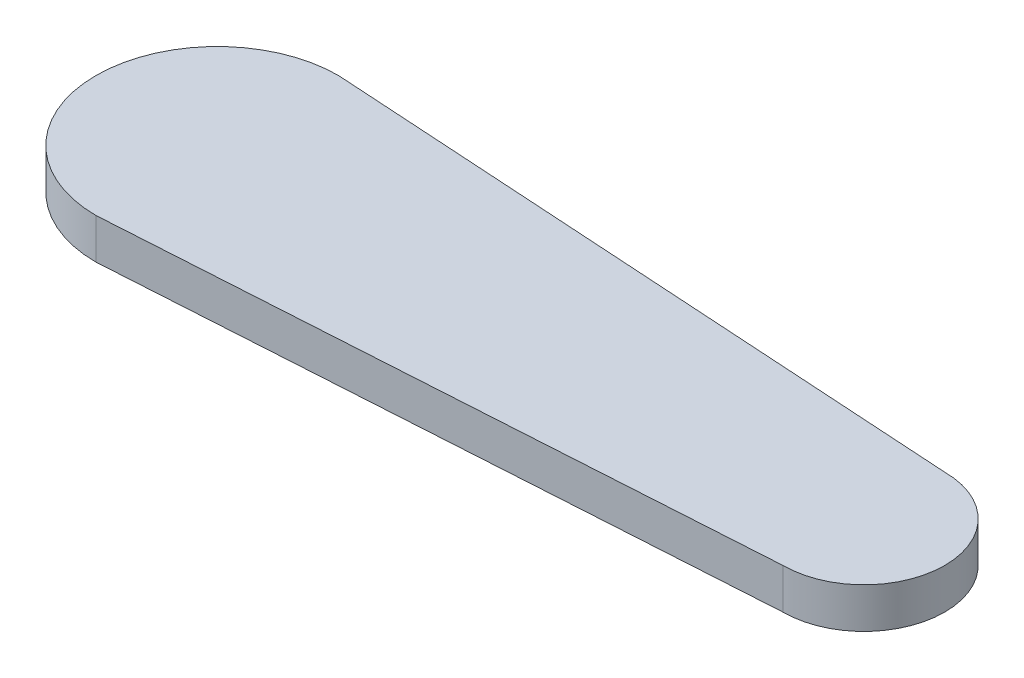
ISO-10303-21;
HEADER;
FILE_DESCRIPTION(('STEP AP214'),'2;1');
FILE_NAME('part.step','',(''),(''),'','','');
FILE_SCHEMA(('AUTOMOTIVE_DESIGN { 1 0 10303 214 1 1 1 1 }'));
ENDSEC;
DATA;
#1=APPLICATION_CONTEXT('core data for automotive mechanical design processes');
#2=APPLICATION_PROTOCOL_DEFINITION('international standard','automotive_design',2000,#1);
#3=PRODUCT_CONTEXT('',#1,'mechanical');
#4=PRODUCT('Part','Part','',(#3));
#5=PRODUCT_RELATED_PRODUCT_CATEGORY('part','',(#4));
#6=PRODUCT_DEFINITION_FORMATION('','',#4);
#7=PRODUCT_DEFINITION_CONTEXT('part definition',#1,'design');
#8=PRODUCT_DEFINITION('design','',#6,#7);
#9=PRODUCT_DEFINITION_SHAPE('','',#8);
#10=(LENGTH_UNIT() NAMED_UNIT(*) SI_UNIT(.MILLI.,.METRE.));
#11=(NAMED_UNIT(*) PLANE_ANGLE_UNIT() SI_UNIT($,.RADIAN.));
#12=(NAMED_UNIT(*) SI_UNIT($,.STERADIAN.) SOLID_ANGLE_UNIT());
#13=UNCERTAINTY_MEASURE_WITH_UNIT(LENGTH_MEASURE(1.E-05),#10,'distance_accuracy_value','');
#14=(GEOMETRIC_REPRESENTATION_CONTEXT(3) GLOBAL_UNCERTAINTY_ASSIGNED_CONTEXT((#13)) GLOBAL_UNIT_ASSIGNED_CONTEXT((#10,
#11,#12)) REPRESENTATION_CONTEXT('',''));
#15=CARTESIAN_POINT('',(0.,0.,0.));
#16=DIRECTION('',(0.,0.,1.));
#17=DIRECTION('',(1.,0.,0.));
#18=AXIS2_PLACEMENT_3D('',#15,#16,#17);
#19=CARTESIAN_POINT('',(0.,0.,0.));
#20=DIRECTION('',(0.,1.,0.));
#21=DIRECTION('',(0.,0.,1.));
#22=AXIS2_PLACEMENT_3D('',#19,#20,#21);
#23=PLANE('',#22);
#24=CARTESIAN_POINT('',(0.,0.,0.));
#25=DIRECTION('',(0.,1.,0.));
#26=DIRECTION('',(0.,0.,1.));
#27=AXIS2_PLACEMENT_3D('',#24,#25,#26);
#28=CIRCLE('',#27,15.);
#29=CARTESIAN_POINT('',(0.,0.,-15.));
#30=VERTEX_POINT('',#29);
#31=CARTESIAN_POINT('',(0.,0.,15.));
#32=VERTEX_POINT('',#31);
#33=EDGE_CURVE('E187',#30,#32,#28,.T.);
#34=ORIENTED_EDGE('',*,*,#33,.F.);
#35=DIRECTION('',(0.998052578482889,0.,0.0623782861551806));
#36=VECTOR('',#35,1.);
#37=CARTESIAN_POINT('',(0.,0.,-15.));
#38=LINE('',#37,#36);
#39=CARTESIAN_POINT('',(80.,0.,-9.99999999999999));
#40=VERTEX_POINT('',#39);
#41=EDGE_CURVE('E201',#30,#40,#38,.T.);
#42=ORIENTED_EDGE('',*,*,#41,.T.);
#43=CARTESIAN_POINT('',(80.,0.,0.));
#44=DIRECTION('',(0.,1.,0.));
#45=DIRECTION('',(0.,0.,1.));
#46=AXIS2_PLACEMENT_3D('',#43,#44,#45);
#47=CIRCLE('',#46,9.99999999999999);
#48=CARTESIAN_POINT('',(80.,0.,9.99999999999999));
#49=VERTEX_POINT('',#48);
#50=EDGE_CURVE('E212',#49,#40,#47,.T.);
#51=ORIENTED_EDGE('',*,*,#50,.F.);
#52=DIRECTION('',(0.998052578482889,0.,-0.0623782861551806));
#53=VECTOR('',#52,1.);
#54=CARTESIAN_POINT('',(0.,0.,15.));
#55=LINE('',#54,#53);
#56=EDGE_CURVE('E192',#32,#49,#55,.T.);
#57=ORIENTED_EDGE('',*,*,#56,.F.);
#58=EDGE_LOOP('',(#34,#42,#51,#57));
#59=FACE_BOUND('',#58,.T.);
#60=CARTESIAN_POINT('',(19.9,0.,-0.809743015161226));
#61=DIRECTION('',(0.,1.,0.));
#62=DIRECTION('',(0.,0.,1.));
#63=AXIS2_PLACEMENT_3D('',#60,#61,#62);
#64=CIRCLE('',#63,1.5);
#65=CARTESIAN_POINT('',(20.062072922643,0.,0.681475402021832));
#66=VERTEX_POINT('',#65);
#67=CARTESIAN_POINT('',(20.062072922643,0.,-2.30096143234428));
#68=VERTEX_POINT('',#67);
#69=EDGE_CURVE('E57',#66,#68,#64,.T.);
#70=ORIENTED_EDGE('',*,*,#69,.T.);
#71=DIRECTION('',(-0.994145611455372,0.,-0.108048615095358));
#72=VECTOR('',#71,1.);
#73=CARTESIAN_POINT('',(20.062072922643,0.,-2.30096143234428));
#74=LINE('',#73,#72);
#75=CARTESIAN_POINT('',(7.1,0.,-3.70974301516123));
#76=VERTEX_POINT('',#75);
#77=EDGE_CURVE('E185',#68,#76,#74,.T.);
#78=ORIENTED_EDGE('',*,*,#77,.T.);
#79=DIRECTION('',(0.,0.,-1.));
#80=VECTOR('',#79,1.);
#81=CARTESIAN_POINT('',(7.1,0.,-3.70974301516123));
#82=LINE('',#81,#80);
#83=CARTESIAN_POINT('',(7.1,0.,-7.55974301516122));
#84=VERTEX_POINT('',#83);
#85=EDGE_CURVE('E459',#76,#84,#82,.T.);
#86=ORIENTED_EDGE('',*,*,#85,.T.);
#87=CARTESIAN_POINT('',(5.2,0.,-7.55974301516122));
#88=DIRECTION('',(0.,1.,0.));
#89=DIRECTION('',(0.,0.,1.));
#90=AXIS2_PLACEMENT_3D('',#87,#88,#89);
#91=CIRCLE('',#90,1.9);
#92=CARTESIAN_POINT('',(3.3,0.,-7.55974301516122));
#93=VERTEX_POINT('',#92);
#94=EDGE_CURVE('E461',#84,#93,#91,.T.);
#95=ORIENTED_EDGE('',*,*,#94,.T.);
#96=DIRECTION('',(0.,0.,1.));
#97=VECTOR('',#96,1.);
#98=CARTESIAN_POINT('',(3.3,0.,-7.55974301516122));
#99=LINE('',#98,#97);
#100=CARTESIAN_POINT('',(3.3,0.,-4.25974301516122));
#101=VERTEX_POINT('',#100);
#102=EDGE_CURVE('E466',#93,#101,#99,.T.);
#103=ORIENTED_EDGE('',*,*,#102,.T.);
#104=DIRECTION('',(0.991542138328882,0.,-0.129785160623963));
#105=VECTOR('',#104,1.);
#106=CARTESIAN_POINT('',(-11.6946777409359,0.,-2.29705622265454));
#107=LINE('',#106,#105);
#108=CARTESIAN_POINT('',(-11.6946777409359,0.,-2.29705622265454));
#109=VERTEX_POINT('',#108);
#110=EDGE_CURVE('E476',#109,#101,#107,.T.);
#111=ORIENTED_EDGE('',*,*,#110,.F.);
#112=CARTESIAN_POINT('',(-11.5,0.,-0.809743015161211));
#113=DIRECTION('',(0.,1.,0.));
#114=DIRECTION('',(0.,0.,1.));
#115=AXIS2_PLACEMENT_3D('',#112,#113,#114);
#116=CIRCLE('',#115,1.5);
#117=CARTESIAN_POINT('',(-11.6946777409359,0.,0.677570192332114));
#118=VERTEX_POINT('',#117);
#119=EDGE_CURVE('E480',#109,#118,#116,.T.);
#120=ORIENTED_EDGE('',*,*,#119,.T.);
#121=DIRECTION('',(0.991542138328882,0.,0.129785160623963));
#122=VECTOR('',#121,1.);
#123=CARTESIAN_POINT('',(-11.6946777409359,0.,0.677570192332114));
#124=LINE('',#123,#122);
#125=CARTESIAN_POINT('',(3.3,0.,2.64025698483879));
#126=VERTEX_POINT('',#125);
#127=EDGE_CURVE('E484',#118,#126,#124,.T.);
#128=ORIENTED_EDGE('',*,*,#127,.T.);
#129=DIRECTION('',(0.,0.,1.));
#130=VECTOR('',#129,1.);
#131=CARTESIAN_POINT('',(3.3,0.,2.64025698483879));
#132=LINE('',#131,#130);
#133=CARTESIAN_POINT('',(3.3,0.,5.94025698483877));
#134=VERTEX_POINT('',#133);
#135=EDGE_CURVE('E425',#126,#134,#132,.T.);
#136=ORIENTED_EDGE('',*,*,#135,.T.);
#137=CARTESIAN_POINT('',(5.2,0.,5.94025698483877));
#138=DIRECTION('',(0.,1.,0.));
#139=DIRECTION('',(0.,0.,1.));
#140=AXIS2_PLACEMENT_3D('',#137,#138,#139);
#141=CIRCLE('',#140,1.9);
#142=CARTESIAN_POINT('',(7.1,0.,5.94025698483877));
#143=VERTEX_POINT('',#142);
#144=EDGE_CURVE('E420',#134,#143,#141,.T.);
#145=ORIENTED_EDGE('',*,*,#144,.T.);
#146=DIRECTION('',(0.,0.,-1.));
#147=VECTOR('',#146,1.);
#148=CARTESIAN_POINT('',(7.1,0.,5.94025698483877));
#149=LINE('',#148,#147);
#150=CARTESIAN_POINT('',(7.1,0.,2.09025698483877));
#151=VERTEX_POINT('',#150);
#152=EDGE_CURVE('E414',#143,#151,#149,.T.);
#153=ORIENTED_EDGE('',*,*,#152,.T.);
#154=DIRECTION('',(-0.994145611455372,0.,0.108048615095358));
#155=VECTOR('',#154,1.);
#156=CARTESIAN_POINT('',(20.062072922643,0.,0.681475402021832));
#157=LINE('',#156,#155);
#158=EDGE_CURVE('E181',#66,#151,#157,.T.);
#159=ORIENTED_EDGE('',*,*,#158,.F.);
#160=EDGE_LOOP('',(#70,#78,#86,#95,#103,#111,#120,#128,#136,#145,#153,#159));
#161=FACE_BOUND('',#160,.T.);
#162=ADVANCED_FACE('F41',(#59,#161),#23,.F.);
#163=CARTESIAN_POINT('',(0.,5.,0.));
#164=DIRECTION('',(0.,-1.,0.));
#165=DIRECTION('',(0.,0.,-1.));
#166=AXIS2_PLACEMENT_3D('',#163,#164,#165);
#167=CYLINDRICAL_SURFACE('',#166,15.);
#168=ORIENTED_EDGE('',*,*,#33,.T.);
#169=DIRECTION('',(0.,-1.,0.));
#170=VECTOR('',#169,1.);
#171=CARTESIAN_POINT('',(0.,5.,15.));
#172=LINE('',#171,#170);
#173=CARTESIAN_POINT('',(0.,5.,15.));
#174=VERTEX_POINT('',#173);
#175=EDGE_CURVE('E11',#174,#32,#172,.T.);
#176=ORIENTED_EDGE('',*,*,#175,.F.);
#177=CARTESIAN_POINT('',(0.,5.,0.));
#178=DIRECTION('',(0.,1.,0.));
#179=DIRECTION('',(0.,0.,1.));
#180=AXIS2_PLACEMENT_3D('',#177,#178,#179);
#181=CIRCLE('',#180,15.);
#182=CARTESIAN_POINT('',(0.,5.,-15.));
#183=VERTEX_POINT('',#182);
#184=EDGE_CURVE('E198',#183,#174,#181,.T.);
#185=ORIENTED_EDGE('',*,*,#184,.F.);
#186=DIRECTION('',(0.,-1.,0.));
#187=VECTOR('',#186,1.);
#188=CARTESIAN_POINT('',(0.,5.,-15.));
#189=LINE('',#188,#187);
#190=EDGE_CURVE('E66',#183,#30,#189,.T.);
#191=ORIENTED_EDGE('',*,*,#190,.T.);
#192=EDGE_LOOP('',(#168,#176,#185,#191));
#193=FACE_BOUND('',#192,.T.);
#194=ADVANCED_FACE('F43',(#193),#167,.T.);
#195=CARTESIAN_POINT('',(0.,5.,15.));
#196=DIRECTION('',(-0.0623782861551806,0.,-0.998052578482889));
#197=DIRECTION('',(-0.998052578482889,0.,0.0623782861551806));
#198=AXIS2_PLACEMENT_3D('',#195,#196,#197);
#199=PLANE('',#198);
#200=ORIENTED_EDGE('',*,*,#56,.T.);
#201=DIRECTION('',(0.,-1.,0.));
#202=VECTOR('',#201,1.);
#203=CARTESIAN_POINT('',(80.,5.,9.99999999999999));
#204=LINE('',#203,#202);
#205=CARTESIAN_POINT('',(80.,5.,9.99999999999999));
#206=VERTEX_POINT('',#205);
#207=EDGE_CURVE('E50',#206,#49,#204,.T.);
#208=ORIENTED_EDGE('',*,*,#207,.F.);
#209=DIRECTION('',(0.998052578482889,0.,-0.0623782861551806));
#210=VECTOR('',#209,1.);
#211=CARTESIAN_POINT('',(0.,5.,15.));
#212=LINE('',#211,#210);
#213=EDGE_CURVE('E92',#174,#206,#212,.T.);
#214=ORIENTED_EDGE('',*,*,#213,.F.);
#215=ORIENTED_EDGE('',*,*,#175,.T.);
#216=EDGE_LOOP('',(#200,#208,#214,#215));
#217=FACE_BOUND('',#216,.T.);
#218=ADVANCED_FACE('F237',(#217),#199,.F.);
#219=CARTESIAN_POINT('',(80.,5.,0.));
#220=DIRECTION('',(0.,-1.,0.));
#221=DIRECTION('',(0.,0.,-1.));
#222=AXIS2_PLACEMENT_3D('',#219,#220,#221);
#223=CYLINDRICAL_SURFACE('',#222,9.99999999999999);
#224=ORIENTED_EDGE('',*,*,#50,.T.);
#225=DIRECTION('',(0.,-1.,0.));
#226=VECTOR('',#225,1.);
#227=CARTESIAN_POINT('',(80.,5.,-9.99999999999999));
#228=LINE('',#227,#226);
#229=CARTESIAN_POINT('',(80.,5.,-9.99999999999999));
#230=VERTEX_POINT('',#229);
#231=EDGE_CURVE('E221',#230,#40,#228,.T.);
#232=ORIENTED_EDGE('',*,*,#231,.F.);
#233=CARTESIAN_POINT('',(80.,5.,0.));
#234=DIRECTION('',(0.,1.,0.));
#235=DIRECTION('',(0.,0.,1.));
#236=AXIS2_PLACEMENT_3D('',#233,#234,#235);
#237=CIRCLE('',#236,9.99999999999999);
#238=EDGE_CURVE('E204',#206,#230,#237,.T.);
#239=ORIENTED_EDGE('',*,*,#238,.F.);
#240=ORIENTED_EDGE('',*,*,#207,.T.);
#241=EDGE_LOOP('',(#224,#232,#239,#240));
#242=FACE_BOUND('',#241,.T.);
#243=ADVANCED_FACE('F228',(#242),#223,.T.);
#244=CARTESIAN_POINT('',(0.,5.,-15.));
#245=DIRECTION('',(0.0623782861551806,0.,-0.998052578482889));
#246=DIRECTION('',(-0.998052578482889,0.,-0.0623782861551806));
#247=AXIS2_PLACEMENT_3D('',#244,#245,#246);
#248=PLANE('',#247);
#249=ORIENTED_EDGE('',*,*,#41,.F.);
#250=ORIENTED_EDGE('',*,*,#190,.F.);
#251=DIRECTION('',(0.998052578482889,0.,0.0623782861551806));
#252=VECTOR('',#251,1.);
#253=CARTESIAN_POINT('',(0.,5.,-15.));
#254=LINE('',#253,#252);
#255=EDGE_CURVE('E207',#183,#230,#254,.T.);
#256=ORIENTED_EDGE('',*,*,#255,.T.);
#257=ORIENTED_EDGE('',*,*,#231,.T.);
#258=EDGE_LOOP('',(#249,#250,#256,#257));
#259=FACE_BOUND('',#258,.T.);
#260=ADVANCED_FACE('F232',(#259),#248,.T.);
#261=CARTESIAN_POINT('',(0.,5.,0.));
#262=DIRECTION('',(0.,1.,0.));
#263=DIRECTION('',(0.,0.,1.));
#264=AXIS2_PLACEMENT_3D('',#261,#262,#263);
#265=PLANE('',#264);
#266=ORIENTED_EDGE('',*,*,#184,.T.);
#267=ORIENTED_EDGE('',*,*,#213,.T.);
#268=ORIENTED_EDGE('',*,*,#238,.T.);
#269=ORIENTED_EDGE('',*,*,#255,.F.);
#270=EDGE_LOOP('',(#266,#267,#268,#269));
#271=FACE_BOUND('',#270,.T.);
#272=ADVANCED_FACE('F235',(#271),#265,.T.);
#273=CARTESIAN_POINT('',(19.9,1.5,-0.809743015161226));
#274=DIRECTION('',(0.,-1.,0.));
#275=DIRECTION('',(0.,0.,-1.));
#276=AXIS2_PLACEMENT_3D('',#273,#274,#275);
#277=CYLINDRICAL_SURFACE('',#276,1.5);
#278=ORIENTED_EDGE('',*,*,#69,.F.);
#279=DIRECTION('',(0.,-1.,0.));
#280=VECTOR('',#279,1.);
#281=CARTESIAN_POINT('',(20.062072922643,1.5,0.681475402021832));
#282=LINE('',#281,#280);
#283=CARTESIAN_POINT('',(20.062072922643,1.5,0.681475402021832));
#284=VERTEX_POINT('',#283);
#285=EDGE_CURVE('E179',#284,#66,#282,.T.);
#286=ORIENTED_EDGE('',*,*,#285,.F.);
#287=CARTESIAN_POINT('',(19.9,1.5,-0.809743015161226));
#288=DIRECTION('',(0.,1.,0.));
#289=DIRECTION('',(0.,0.,1.));
#290=AXIS2_PLACEMENT_3D('',#287,#288,#289);
#291=CIRCLE('',#290,1.5);
#292=CARTESIAN_POINT('',(20.062072922643,1.5,-2.30096143234428));
#293=VERTEX_POINT('',#292);
#294=EDGE_CURVE('E168',#284,#293,#291,.T.);
#295=ORIENTED_EDGE('',*,*,#294,.T.);
#296=DIRECTION('',(0.,-1.,0.));
#297=VECTOR('',#296,1.);
#298=CARTESIAN_POINT('',(20.062072922643,1.5,-2.30096143234428));
#299=LINE('',#298,#297);
#300=EDGE_CURVE('E178',#293,#68,#299,.T.);
#301=ORIENTED_EDGE('',*,*,#300,.T.);
#302=EDGE_LOOP('',(#278,#286,#295,#301));
#303=FACE_BOUND('',#302,.T.);
#304=ADVANCED_FACE('F177',(#303),#277,.F.);
#305=CARTESIAN_POINT('',(20.062072922643,1.5,-2.30096143234428));
#306=DIRECTION('',(-0.108048615095358,0.,0.994145611455372));
#307=DIRECTION('',(0.994145611455372,0.,0.108048615095358));
#308=AXIS2_PLACEMENT_3D('',#305,#306,#307);
#309=PLANE('',#308);
#310=ORIENTED_EDGE('',*,*,#77,.F.);
#311=ORIENTED_EDGE('',*,*,#300,.F.);
#312=DIRECTION('',(-0.994145611455372,0.,-0.108048615095358));
#313=VECTOR('',#312,1.);
#314=CARTESIAN_POINT('',(20.062072922643,1.5,-2.30096143234428));
#315=LINE('',#314,#313);
#316=CARTESIAN_POINT('',(7.1,1.5,-3.70974301516123));
#317=VERTEX_POINT('',#316);
#318=EDGE_CURVE('E164',#293,#317,#315,.T.);
#319=ORIENTED_EDGE('',*,*,#318,.T.);
#320=DIRECTION('',(0.,-1.,0.));
#321=VECTOR('',#320,1.);
#322=CARTESIAN_POINT('',(7.1,1.5,-3.70974301516123));
#323=LINE('',#322,#321);
#324=EDGE_CURVE('E188',#317,#76,#323,.T.);
#325=ORIENTED_EDGE('',*,*,#324,.T.);
#326=EDGE_LOOP('',(#310,#311,#319,#325));
#327=FACE_BOUND('',#326,.T.);
#328=ADVANCED_FACE('F183',(#327),#309,.T.);
#329=CARTESIAN_POINT('',(7.1,1.5,-3.70974301516123));
#330=DIRECTION('',(-1.,0.,0.));
#331=DIRECTION('',(0.,0.,1.));
#332=AXIS2_PLACEMENT_3D('',#329,#330,#331);
#333=PLANE('',#332);
#334=ORIENTED_EDGE('',*,*,#85,.F.);
#335=ORIENTED_EDGE('',*,*,#324,.F.);
#336=DIRECTION('',(0.,0.,-1.));
#337=VECTOR('',#336,1.);
#338=CARTESIAN_POINT('',(7.1,1.5,-3.70974301516123));
#339=LINE('',#338,#337);
#340=CARTESIAN_POINT('',(7.1,1.5,-7.55974301516122));
#341=VERTEX_POINT('',#340);
#342=EDGE_CURVE('E171',#317,#341,#339,.T.);
#343=ORIENTED_EDGE('',*,*,#342,.T.);
#344=DIRECTION('',(0.,-1.,0.));
#345=VECTOR('',#344,1.);
#346=CARTESIAN_POINT('',(7.1,1.5,-7.55974301516122));
#347=LINE('',#346,#345);
#348=EDGE_CURVE('E194',#341,#84,#347,.T.);
#349=ORIENTED_EDGE('',*,*,#348,.T.);
#350=EDGE_LOOP('',(#334,#335,#343,#349));
#351=FACE_BOUND('',#350,.T.);
#352=ADVANCED_FACE('F261',(#351),#333,.T.);
#353=CARTESIAN_POINT('',(5.2,1.5,-7.55974301516122));
#354=DIRECTION('',(0.,-1.,0.));
#355=DIRECTION('',(0.,0.,-1.));
#356=AXIS2_PLACEMENT_3D('',#353,#354,#355);
#357=CYLINDRICAL_SURFACE('',#356,1.9);
#358=ORIENTED_EDGE('',*,*,#94,.F.);
#359=ORIENTED_EDGE('',*,*,#348,.F.);
#360=CARTESIAN_POINT('',(5.2,1.5,-7.55974301516122));
#361=DIRECTION('',(0.,1.,0.));
#362=DIRECTION('',(0.,0.,1.));
#363=AXIS2_PLACEMENT_3D('',#360,#361,#362);
#364=CIRCLE('',#363,1.9);
#365=CARTESIAN_POINT('',(3.3,1.5,-7.55974301516122));
#366=VERTEX_POINT('',#365);
#367=EDGE_CURVE('E521',#341,#366,#364,.T.);
#368=ORIENTED_EDGE('',*,*,#367,.T.);
#369=DIRECTION('',(0.,-1.,0.));
#370=VECTOR('',#369,1.);
#371=CARTESIAN_POINT('',(3.3,1.5,-7.55974301516122));
#372=LINE('',#371,#370);
#373=EDGE_CURVE('E452',#366,#93,#372,.T.);
#374=ORIENTED_EDGE('',*,*,#373,.T.);
#375=EDGE_LOOP('',(#358,#359,#368,#374));
#376=FACE_BOUND('',#375,.T.);
#377=ADVANCED_FACE('F266',(#376),#357,.F.);
#378=CARTESIAN_POINT('',(3.3,1.5,-7.55974301516122));
#379=DIRECTION('',(1.,0.,0.));
#380=DIRECTION('',(0.,0.,-1.));
#381=AXIS2_PLACEMENT_3D('',#378,#379,#380);
#382=PLANE('',#381);
#383=ORIENTED_EDGE('',*,*,#102,.F.);
#384=ORIENTED_EDGE('',*,*,#373,.F.);
#385=DIRECTION('',(0.,0.,1.));
#386=VECTOR('',#385,1.);
#387=CARTESIAN_POINT('',(3.3,1.5,-7.55974301516122));
#388=LINE('',#387,#386);
#389=CARTESIAN_POINT('',(3.3,1.5,-4.25974301516122));
#390=VERTEX_POINT('',#389);
#391=EDGE_CURVE('E518',#366,#390,#388,.T.);
#392=ORIENTED_EDGE('',*,*,#391,.T.);
#393=DIRECTION('',(0.,-1.,0.));
#394=VECTOR('',#393,1.);
#395=CARTESIAN_POINT('',(3.3,1.5,-4.25974301516122));
#396=LINE('',#395,#394);
#397=EDGE_CURVE('E449',#390,#101,#396,.T.);
#398=ORIENTED_EDGE('',*,*,#397,.T.);
#399=EDGE_LOOP('',(#383,#384,#392,#398));
#400=FACE_BOUND('',#399,.T.);
#401=ADVANCED_FACE('F270',(#400),#382,.T.);
#402=CARTESIAN_POINT('',(-11.6946777409359,1.5,-2.29705622265454));
#403=DIRECTION('',(-0.129785160623963,0.,-0.991542138328882));
#404=DIRECTION('',(-0.991542138328882,0.,0.129785160623963));
#405=AXIS2_PLACEMENT_3D('',#402,#403,#404);
#406=PLANE('',#405);
#407=ORIENTED_EDGE('',*,*,#110,.T.);
#408=ORIENTED_EDGE('',*,*,#397,.F.);
#409=DIRECTION('',(0.991542138328882,0.,-0.129785160623963));
#410=VECTOR('',#409,1.);
#411=CARTESIAN_POINT('',(-11.6946777409359,1.5,-2.29705622265454));
#412=LINE('',#411,#410);
#413=CARTESIAN_POINT('',(-11.6946777409359,1.5,-2.29705622265454));
#414=VERTEX_POINT('',#413);
#415=EDGE_CURVE('E514',#414,#390,#412,.T.);
#416=ORIENTED_EDGE('',*,*,#415,.F.);
#417=DIRECTION('',(0.,-1.,0.));
#418=VECTOR('',#417,1.);
#419=CARTESIAN_POINT('',(-11.6946777409359,1.5,-2.29705622265454));
#420=LINE('',#419,#418);
#421=EDGE_CURVE('E446',#414,#109,#420,.T.);
#422=ORIENTED_EDGE('',*,*,#421,.T.);
#423=EDGE_LOOP('',(#407,#408,#416,#422));
#424=FACE_BOUND('',#423,.T.);
#425=ADVANCED_FACE('F274',(#424),#406,.F.);
#426=CARTESIAN_POINT('',(-11.5,1.5,-0.809743015161211));
#427=DIRECTION('',(0.,-1.,0.));
#428=DIRECTION('',(0.,0.,-1.));
#429=AXIS2_PLACEMENT_3D('',#426,#427,#428);
#430=CYLINDRICAL_SURFACE('',#429,1.5);
#431=ORIENTED_EDGE('',*,*,#119,.F.);
#432=ORIENTED_EDGE('',*,*,#421,.F.);
#433=CARTESIAN_POINT('',(-11.5,1.5,-0.809743015161211));
#434=DIRECTION('',(0.,1.,0.));
#435=DIRECTION('',(0.,0.,1.));
#436=AXIS2_PLACEMENT_3D('',#433,#434,#435);
#437=CIRCLE('',#436,1.5);
#438=CARTESIAN_POINT('',(-11.6946777409359,1.5,0.677570192332114));
#439=VERTEX_POINT('',#438);
#440=EDGE_CURVE('E511',#414,#439,#437,.T.);
#441=ORIENTED_EDGE('',*,*,#440,.T.);
#442=DIRECTION('',(0.,-1.,0.));
#443=VECTOR('',#442,1.);
#444=CARTESIAN_POINT('',(-11.6946777409359,1.5,0.677570192332114));
#445=LINE('',#444,#443);
#446=EDGE_CURVE('E443',#439,#118,#445,.T.);
#447=ORIENTED_EDGE('',*,*,#446,.T.);
#448=EDGE_LOOP('',(#431,#432,#441,#447));
#449=FACE_BOUND('',#448,.T.);
#450=ADVANCED_FACE('F278',(#449),#430,.F.);
#451=CARTESIAN_POINT('',(-11.6946777409359,1.5,0.677570192332114));
#452=DIRECTION('',(0.129785160623963,0.,-0.991542138328882));
#453=DIRECTION('',(-0.991542138328882,0.,-0.129785160623963));
#454=AXIS2_PLACEMENT_3D('',#451,#452,#453);
#455=PLANE('',#454);
#456=ORIENTED_EDGE('',*,*,#127,.F.);
#457=ORIENTED_EDGE('',*,*,#446,.F.);
#458=DIRECTION('',(0.991542138328882,0.,0.129785160623963));
#459=VECTOR('',#458,1.);
#460=CARTESIAN_POINT('',(-11.6946777409359,1.5,0.677570192332114));
#461=LINE('',#460,#459);
#462=CARTESIAN_POINT('',(3.3,1.5,2.64025698483879));
#463=VERTEX_POINT('',#462);
#464=EDGE_CURVE('E508',#439,#463,#461,.T.);
#465=ORIENTED_EDGE('',*,*,#464,.T.);
#466=DIRECTION('',(0.,-1.,0.));
#467=VECTOR('',#466,1.);
#468=CARTESIAN_POINT('',(3.3,1.5,2.64025698483879));
#469=LINE('',#468,#467);
#470=EDGE_CURVE('E440',#463,#126,#469,.T.);
#471=ORIENTED_EDGE('',*,*,#470,.T.);
#472=EDGE_LOOP('',(#456,#457,#465,#471));
#473=FACE_BOUND('',#472,.T.);
#474=ADVANCED_FACE('F282',(#473),#455,.T.);
#475=CARTESIAN_POINT('',(3.3,1.5,2.64025698483879));
#476=DIRECTION('',(1.,0.,0.));
#477=DIRECTION('',(0.,0.,-1.));
#478=AXIS2_PLACEMENT_3D('',#475,#476,#477);
#479=PLANE('',#478);
#480=ORIENTED_EDGE('',*,*,#135,.F.);
#481=ORIENTED_EDGE('',*,*,#470,.F.);
#482=DIRECTION('',(0.,0.,1.));
#483=VECTOR('',#482,1.);
#484=CARTESIAN_POINT('',(3.3,1.5,2.64025698483879));
#485=LINE('',#484,#483);
#486=CARTESIAN_POINT('',(3.3,1.5,5.94025698483877));
#487=VERTEX_POINT('',#486);
#488=EDGE_CURVE('E493',#463,#487,#485,.T.);
#489=ORIENTED_EDGE('',*,*,#488,.T.);
#490=DIRECTION('',(0.,-1.,0.));
#491=VECTOR('',#490,1.);
#492=CARTESIAN_POINT('',(3.3,1.5,5.94025698483877));
#493=LINE('',#492,#491);
#494=EDGE_CURVE('E437',#487,#134,#493,.T.);
#495=ORIENTED_EDGE('',*,*,#494,.T.);
#496=EDGE_LOOP('',(#480,#481,#489,#495));
#497=FACE_BOUND('',#496,.T.);
#498=ADVANCED_FACE('F286',(#497),#479,.T.);
#499=CARTESIAN_POINT('',(5.2,1.5,5.94025698483877));
#500=DIRECTION('',(0.,-1.,0.));
#501=DIRECTION('',(0.,0.,-1.));
#502=AXIS2_PLACEMENT_3D('',#499,#500,#501);
#503=CYLINDRICAL_SURFACE('',#502,1.9);
#504=ORIENTED_EDGE('',*,*,#144,.F.);
#505=ORIENTED_EDGE('',*,*,#494,.F.);
#506=CARTESIAN_POINT('',(5.2,1.5,5.94025698483877));
#507=DIRECTION('',(0.,1.,0.));
#508=DIRECTION('',(0.,0.,1.));
#509=AXIS2_PLACEMENT_3D('',#506,#507,#508);
#510=CIRCLE('',#509,1.9);
#511=CARTESIAN_POINT('',(7.1,1.5,5.94025698483877));
#512=VERTEX_POINT('',#511);
#513=EDGE_CURVE('E495',#487,#512,#510,.T.);
#514=ORIENTED_EDGE('',*,*,#513,.T.);
#515=DIRECTION('',(0.,-1.,0.));
#516=VECTOR('',#515,1.);
#517=CARTESIAN_POINT('',(7.1,1.5,5.94025698483877));
#518=LINE('',#517,#516);
#519=EDGE_CURVE('E434',#512,#143,#518,.T.);
#520=ORIENTED_EDGE('',*,*,#519,.T.);
#521=EDGE_LOOP('',(#504,#505,#514,#520));
#522=FACE_BOUND('',#521,.T.);
#523=ADVANCED_FACE('F290',(#522),#503,.F.);
#524=CARTESIAN_POINT('',(7.1,1.5,5.94025698483877));
#525=DIRECTION('',(-1.,0.,0.));
#526=DIRECTION('',(0.,0.,1.));
#527=AXIS2_PLACEMENT_3D('',#524,#525,#526);
#528=PLANE('',#527);
#529=ORIENTED_EDGE('',*,*,#152,.F.);
#530=ORIENTED_EDGE('',*,*,#519,.F.);
#531=DIRECTION('',(0.,0.,-1.));
#532=VECTOR('',#531,1.);
#533=CARTESIAN_POINT('',(7.1,1.5,5.94025698483877));
#534=LINE('',#533,#532);
#535=CARTESIAN_POINT('',(7.1,1.5,2.09025698483877));
#536=VERTEX_POINT('',#535);
#537=EDGE_CURVE('E497',#512,#536,#534,.T.);
#538=ORIENTED_EDGE('',*,*,#537,.T.);
#539=DIRECTION('',(0.,-1.,0.));
#540=VECTOR('',#539,1.);
#541=CARTESIAN_POINT('',(7.1,1.5,2.09025698483877));
#542=LINE('',#541,#540);
#543=EDGE_CURVE('E412',#536,#151,#542,.T.);
#544=ORIENTED_EDGE('',*,*,#543,.T.);
#545=EDGE_LOOP('',(#529,#530,#538,#544));
#546=FACE_BOUND('',#545,.T.);
#547=ADVANCED_FACE('F294',(#546),#528,.T.);
#548=CARTESIAN_POINT('',(20.062072922643,1.5,0.681475402021832));
#549=DIRECTION('',(0.108048615095358,0.,0.994145611455372));
#550=DIRECTION('',(0.994145611455372,0.,-0.108048615095358));
#551=AXIS2_PLACEMENT_3D('',#548,#549,#550);
#552=PLANE('',#551);
#553=ORIENTED_EDGE('',*,*,#158,.T.);
#554=ORIENTED_EDGE('',*,*,#543,.F.);
#555=DIRECTION('',(-0.994145611455372,0.,0.108048615095358));
#556=VECTOR('',#555,1.);
#557=CARTESIAN_POINT('',(20.062072922643,1.5,0.681475402021832));
#558=LINE('',#557,#556);
#559=EDGE_CURVE('E431',#284,#536,#558,.T.);
#560=ORIENTED_EDGE('',*,*,#559,.F.);
#561=ORIENTED_EDGE('',*,*,#285,.T.);
#562=EDGE_LOOP('',(#553,#554,#560,#561));
#563=FACE_BOUND('',#562,.T.);
#564=ADVANCED_FACE('F298',(#563),#552,.F.);
#565=CARTESIAN_POINT('',(19.9,1.5,-0.809743015161226));
#566=DIRECTION('',(0.,1.,0.));
#567=DIRECTION('',(0.,0.,1.));
#568=AXIS2_PLACEMENT_3D('',#565,#566,#567);
#569=PLANE('',#568);
#570=ORIENTED_EDGE('',*,*,#294,.F.);
#571=ORIENTED_EDGE('',*,*,#559,.T.);
#572=ORIENTED_EDGE('',*,*,#537,.F.);
#573=ORIENTED_EDGE('',*,*,#513,.F.);
#574=ORIENTED_EDGE('',*,*,#488,.F.);
#575=ORIENTED_EDGE('',*,*,#464,.F.);
#576=ORIENTED_EDGE('',*,*,#440,.F.);
#577=ORIENTED_EDGE('',*,*,#415,.T.);
#578=ORIENTED_EDGE('',*,*,#391,.F.);
#579=ORIENTED_EDGE('',*,*,#367,.F.);
#580=ORIENTED_EDGE('',*,*,#342,.F.);
#581=ORIENTED_EDGE('',*,*,#318,.F.);
#582=EDGE_LOOP('',(#570,#571,#572,#573,#574,#575,#576,#577,#578,#579,#580,#581));
#583=FACE_BOUND('',#582,.T.);
#584=ADVANCED_FACE('F166',(#583),#569,.F.);
#585=CLOSED_SHELL('',(#162,#194,#218,#243,#260,#272,#304,#328,#352,#377,#401,#425,#450,#474,
#498,#523,#547,#564,#584));
#586=MANIFOLD_SOLID_BREP('B2',#585);
#587=ADVANCED_BREP_SHAPE_REPRESENTATION('',(#18,#586),#14);
#588=SHAPE_DEFINITION_REPRESENTATION(#9,#587);
ENDSEC;
END-ISO-10303-21;
